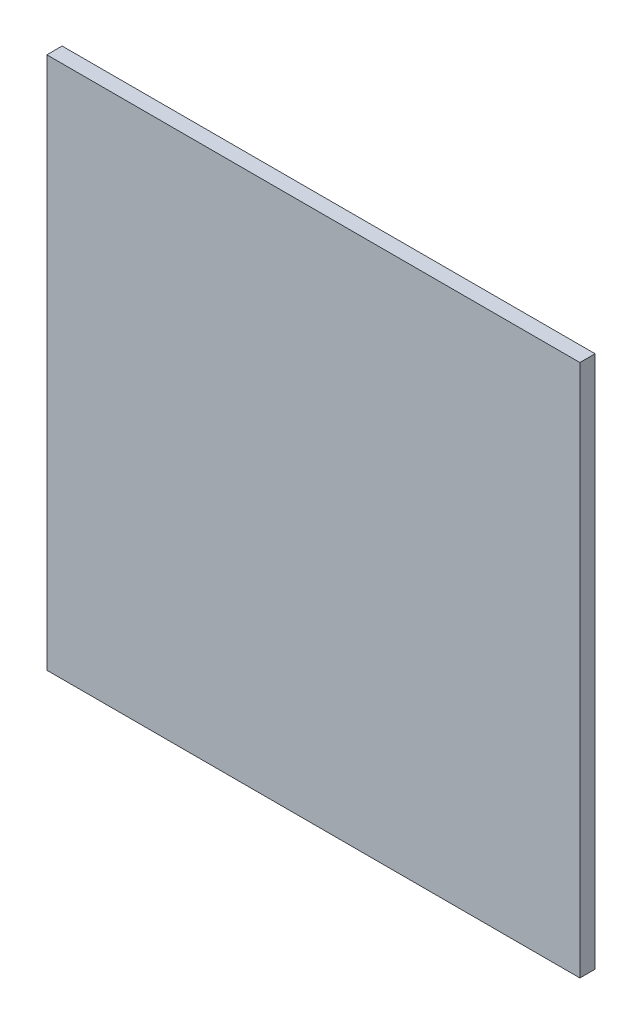
ISO-10303-21;
HEADER;
FILE_DESCRIPTION(('STEP AP214'),'2;1');
FILE_NAME('part.step','',(''),(''),'','','');
FILE_SCHEMA(('AUTOMOTIVE_DESIGN { 1 0 10303 214 1 1 1 1 }'));
ENDSEC;
DATA;
#1=APPLICATION_CONTEXT('core data for automotive mechanical design processes');
#2=APPLICATION_PROTOCOL_DEFINITION('international standard','automotive_design',2000,#1);
#3=PRODUCT_CONTEXT('',#1,'mechanical');
#4=PRODUCT('Part','Part','',(#3));
#5=PRODUCT_RELATED_PRODUCT_CATEGORY('part','',(#4));
#6=PRODUCT_DEFINITION_FORMATION('','',#4);
#7=PRODUCT_DEFINITION_CONTEXT('part definition',#1,'design');
#8=PRODUCT_DEFINITION('design','',#6,#7);
#9=PRODUCT_DEFINITION_SHAPE('','',#8);
#10=(LENGTH_UNIT() NAMED_UNIT(*) SI_UNIT(.MILLI.,.METRE.));
#11=(NAMED_UNIT(*) PLANE_ANGLE_UNIT() SI_UNIT($,.RADIAN.));
#12=(NAMED_UNIT(*) SI_UNIT($,.STERADIAN.) SOLID_ANGLE_UNIT());
#13=UNCERTAINTY_MEASURE_WITH_UNIT(LENGTH_MEASURE(1.E-05),#10,'distance_accuracy_value','');
#14=(GEOMETRIC_REPRESENTATION_CONTEXT(3) GLOBAL_UNCERTAINTY_ASSIGNED_CONTEXT((#13)) GLOBAL_UNIT_ASSIGNED_CONTEXT((#10,
#11,#12)) REPRESENTATION_CONTEXT('',''));
#15=CARTESIAN_POINT('',(0.,0.,0.));
#16=DIRECTION('',(0.,0.,1.));
#17=DIRECTION('',(1.,0.,0.));
#18=AXIS2_PLACEMENT_3D('',#15,#16,#17);
#19=CARTESIAN_POINT('',(0.,0.,1.));
#20=DIRECTION('',(1.,0.,0.));
#21=DIRECTION('',(0.,1.,0.));
#22=AXIS2_PLACEMENT_3D('',#19,#20,#21);
#23=PLANE('',#22);
#24=DIRECTION('',(0.,-1.,0.));
#25=VECTOR('',#24,1.);
#26=CARTESIAN_POINT('',(0.,0.,0.));
#27=LINE('',#26,#25);
#28=CARTESIAN_POINT('',(0.,0.,0.));
#29=VERTEX_POINT('',#28);
#30=CARTESIAN_POINT('',(0.,-35.,0.));
#31=VERTEX_POINT('',#30);
#32=EDGE_CURVE('E103',#29,#31,#27,.T.);
#33=ORIENTED_EDGE('',*,*,#32,.T.);
#34=DIRECTION('',(0.,0.,-1.));
#35=VECTOR('',#34,1.);
#36=CARTESIAN_POINT('',(0.,-35.,1.));
#37=LINE('',#36,#35);
#38=CARTESIAN_POINT('',(0.,-35.,1.));
#39=VERTEX_POINT('',#38);
#40=EDGE_CURVE('E94',#39,#31,#37,.T.);
#41=ORIENTED_EDGE('',*,*,#40,.F.);
#42=DIRECTION('',(0.,-1.,0.));
#43=VECTOR('',#42,1.);
#44=CARTESIAN_POINT('',(0.,0.,1.));
#45=LINE('',#44,#43);
#46=CARTESIAN_POINT('',(0.,0.,1.));
#47=VERTEX_POINT('',#46);
#48=EDGE_CURVE('E88',#47,#39,#45,.T.);
#49=ORIENTED_EDGE('',*,*,#48,.F.);
#50=DIRECTION('',(0.,0.,-1.));
#51=VECTOR('',#50,1.);
#52=CARTESIAN_POINT('',(0.,0.,1.));
#53=LINE('',#52,#51);
#54=EDGE_CURVE('E99',#47,#29,#53,.T.);
#55=ORIENTED_EDGE('',*,*,#54,.T.);
#56=EDGE_LOOP('',(#33,#41,#49,#55));
#57=FACE_BOUND('',#56,.T.);
#58=ADVANCED_FACE('F34',(#57),#23,.F.);
#59=CARTESIAN_POINT('',(0.,-35.,1.));
#60=DIRECTION('',(0.,1.,0.));
#61=DIRECTION('',(0.,0.,1.));
#62=AXIS2_PLACEMENT_3D('',#59,#60,#61);
#63=PLANE('',#62);
#64=DIRECTION('',(1.,0.,0.));
#65=VECTOR('',#64,1.);
#66=CARTESIAN_POINT('',(0.,-35.,0.));
#67=LINE('',#66,#65);
#68=CARTESIAN_POINT('',(35.,-35.,0.));
#69=VERTEX_POINT('',#68);
#70=EDGE_CURVE('E93',#31,#69,#67,.T.);
#71=ORIENTED_EDGE('',*,*,#70,.T.);
#72=DIRECTION('',(0.,0.,-1.));
#73=VECTOR('',#72,1.);
#74=CARTESIAN_POINT('',(35.,-35.,1.));
#75=LINE('',#74,#73);
#76=CARTESIAN_POINT('',(35.,-35.,1.));
#77=VERTEX_POINT('',#76);
#78=EDGE_CURVE('E91',#77,#69,#75,.T.);
#79=ORIENTED_EDGE('',*,*,#78,.F.);
#80=DIRECTION('',(1.,0.,0.));
#81=VECTOR('',#80,1.);
#82=CARTESIAN_POINT('',(0.,-35.,1.));
#83=LINE('',#82,#81);
#84=EDGE_CURVE('E83',#39,#77,#83,.T.);
#85=ORIENTED_EDGE('',*,*,#84,.F.);
#86=ORIENTED_EDGE('',*,*,#40,.T.);
#87=EDGE_LOOP('',(#71,#79,#85,#86));
#88=FACE_BOUND('',#87,.T.);
#89=ADVANCED_FACE('F92',(#88),#63,.F.);
#90=CARTESIAN_POINT('',(35.,0.,1.));
#91=DIRECTION('',(-1.,0.,0.));
#92=DIRECTION('',(0.,-1.,0.));
#93=AXIS2_PLACEMENT_3D('',#90,#91,#92);
#94=PLANE('',#93);
#95=DIRECTION('',(0.,1.,0.));
#96=VECTOR('',#95,1.);
#97=CARTESIAN_POINT('',(35.,0.,0.));
#98=LINE('',#97,#96);
#99=CARTESIAN_POINT('',(35.,0.,0.));
#100=VERTEX_POINT('',#99);
#101=EDGE_CURVE('E69',#69,#100,#98,.T.);
#102=ORIENTED_EDGE('',*,*,#101,.T.);
#103=DIRECTION('',(0.,0.,-1.));
#104=VECTOR('',#103,1.);
#105=CARTESIAN_POINT('',(35.,0.,1.));
#106=LINE('',#105,#104);
#107=CARTESIAN_POINT('',(35.,0.,1.));
#108=VERTEX_POINT('',#107);
#109=EDGE_CURVE('E95',#108,#100,#106,.T.);
#110=ORIENTED_EDGE('',*,*,#109,.F.);
#111=DIRECTION('',(0.,1.,0.));
#112=VECTOR('',#111,1.);
#113=CARTESIAN_POINT('',(35.,0.,1.));
#114=LINE('',#113,#112);
#115=EDGE_CURVE('E86',#77,#108,#114,.T.);
#116=ORIENTED_EDGE('',*,*,#115,.F.);
#117=ORIENTED_EDGE('',*,*,#78,.T.);
#118=EDGE_LOOP('',(#102,#110,#116,#117));
#119=FACE_BOUND('',#118,.T.);
#120=ADVANCED_FACE('F97',(#119),#94,.F.);
#121=CARTESIAN_POINT('',(0.,0.,1.));
#122=DIRECTION('',(0.,-1.,0.));
#123=DIRECTION('',(0.,0.,-1.));
#124=AXIS2_PLACEMENT_3D('',#121,#122,#123);
#125=PLANE('',#124);
#126=DIRECTION('',(-1.,0.,0.));
#127=VECTOR('',#126,1.);
#128=CARTESIAN_POINT('',(0.,0.,0.));
#129=LINE('',#128,#127);
#130=EDGE_CURVE('E75',#100,#29,#129,.T.);
#131=ORIENTED_EDGE('',*,*,#130,.T.);
#132=ORIENTED_EDGE('',*,*,#54,.F.);
#133=DIRECTION('',(-1.,0.,0.));
#134=VECTOR('',#133,1.);
#135=CARTESIAN_POINT('',(0.,0.,1.));
#136=LINE('',#135,#134);
#137=EDGE_CURVE('E52',#108,#47,#136,.T.);
#138=ORIENTED_EDGE('',*,*,#137,.F.);
#139=ORIENTED_EDGE('',*,*,#109,.T.);
#140=EDGE_LOOP('',(#131,#132,#138,#139));
#141=FACE_BOUND('',#140,.T.);
#142=ADVANCED_FACE('F152',(#141),#125,.F.);
#143=CARTESIAN_POINT('',(0.,0.,1.));
#144=DIRECTION('',(0.,0.,1.));
#145=DIRECTION('',(1.,0.,0.));
#146=AXIS2_PLACEMENT_3D('',#143,#144,#145);
#147=PLANE('',#146);
#148=ORIENTED_EDGE('',*,*,#48,.T.);
#149=ORIENTED_EDGE('',*,*,#84,.T.);
#150=ORIENTED_EDGE('',*,*,#115,.T.);
#151=ORIENTED_EDGE('',*,*,#137,.T.);
#152=EDGE_LOOP('',(#148,#149,#150,#151));
#153=FACE_BOUND('',#152,.T.);
#154=ADVANCED_FACE('F84',(#153),#147,.T.);
#155=CARTESIAN_POINT('',(0.,0.,0.));
#156=DIRECTION('',(0.,0.,1.));
#157=DIRECTION('',(1.,0.,0.));
#158=AXIS2_PLACEMENT_3D('',#155,#156,#157);
#159=PLANE('',#158);
#160=CARTESIAN_POINT('',(5.,-17.5,0.));
#161=DIRECTION('',(0.,0.,1.));
#162=DIRECTION('',(1.,0.,0.));
#163=AXIS2_PLACEMENT_3D('',#160,#161,#162);
#164=CIRCLE('',#163,0.999999999999998);
#165=CARTESIAN_POINT('',(6.,-17.5,0.));
#166=VERTEX_POINT('',#165);
#167=EDGE_CURVE('E115',#166,#166,#164,.F.);
#168=ORIENTED_EDGE('',*,*,#167,.F.);
#169=EDGE_LOOP('',(#168));
#170=FACE_BOUND('',#169,.T.);
#171=CARTESIAN_POINT('',(30.,-17.5,0.));
#172=DIRECTION('',(0.,0.,1.));
#173=DIRECTION('',(1.,0.,0.));
#174=AXIS2_PLACEMENT_3D('',#171,#172,#173);
#175=CIRCLE('',#174,0.999999999999998);
#176=CARTESIAN_POINT('',(31.,-17.5,0.));
#177=VERTEX_POINT('',#176);
#178=EDGE_CURVE('E112',#177,#177,#175,.F.);
#179=ORIENTED_EDGE('',*,*,#178,.F.);
#180=EDGE_LOOP('',(#179));
#181=FACE_BOUND('',#180,.T.);
#182=ORIENTED_EDGE('',*,*,#32,.F.);
#183=ORIENTED_EDGE('',*,*,#130,.F.);
#184=ORIENTED_EDGE('',*,*,#101,.F.);
#185=ORIENTED_EDGE('',*,*,#70,.F.);
#186=EDGE_LOOP('',(#182,#183,#184,#185));
#187=FACE_BOUND('',#186,.T.);
#188=ADVANCED_FACE('F155',(#170,#181,#187),#159,.F.);
#189=CARTESIAN_POINT('',(30.,-17.5,-3.));
#190=DIRECTION('',(0.,0.,1.));
#191=DIRECTION('',(1.,0.,0.));
#192=AXIS2_PLACEMENT_3D('',#189,#190,#191);
#193=CYLINDRICAL_SURFACE('',#192,0.999999999999998);
#194=CARTESIAN_POINT('',(30.,-17.5,-2.49999999999999));
#195=DIRECTION('',(0.,0.,-1.));
#196=DIRECTION('',(-1.,0.,0.));
#197=AXIS2_PLACEMENT_3D('',#194,#195,#196);
#198=CIRCLE('',#197,0.999999999999998);
#199=CARTESIAN_POINT('',(29.,-17.5,-2.49999999999999));
#200=VERTEX_POINT('',#199);
#201=EDGE_CURVE('E11',#200,#200,#198,.F.);
#202=ORIENTED_EDGE('',*,*,#201,.T.);
#203=EDGE_LOOP('',(#202));
#204=FACE_BOUND('',#203,.T.);
#205=ORIENTED_EDGE('',*,*,#178,.T.);
#206=EDGE_LOOP('',(#205));
#207=FACE_BOUND('',#206,.T.);
#208=ADVANCED_FACE('F158',(#204,#207),#193,.T.);
#209=CARTESIAN_POINT('',(30.,-17.5,-3.));
#210=DIRECTION('',(0.,0.,-1.));
#211=DIRECTION('',(-1.,0.,0.));
#212=AXIS2_PLACEMENT_3D('',#209,#210,#211);
#213=PLANE('',#212);
#214=CARTESIAN_POINT('',(30.,-17.5,-3.));
#215=DIRECTION('',(0.,0.,-1.));
#216=DIRECTION('',(-1.,0.,0.));
#217=AXIS2_PLACEMENT_3D('',#214,#215,#216);
#218=CIRCLE('',#217,0.499999999999994);
#219=CARTESIAN_POINT('',(29.5,-17.5,-3.));
#220=VERTEX_POINT('',#219);
#221=EDGE_CURVE('E44',#220,#220,#218,.T.);
#222=ORIENTED_EDGE('',*,*,#221,.T.);
#223=EDGE_LOOP('',(#222));
#224=FACE_BOUND('',#223,.T.);
#225=ADVANCED_FACE('F126',(#224),#213,.T.);
#226=CARTESIAN_POINT('',(5.,-17.5,-3.));
#227=DIRECTION('',(0.,0.,1.));
#228=DIRECTION('',(1.,0.,0.));
#229=AXIS2_PLACEMENT_3D('',#226,#227,#228);
#230=CYLINDRICAL_SURFACE('',#229,0.999999999999998);
#231=CARTESIAN_POINT('',(5.,-17.5,-2.50000000000001));
#232=DIRECTION('',(0.,0.,-1.));
#233=DIRECTION('',(-1.,0.,0.));
#234=AXIS2_PLACEMENT_3D('',#231,#232,#233);
#235=CIRCLE('',#234,0.999999999999998);
#236=CARTESIAN_POINT('',(4.,-17.5,-2.50000000000001));
#237=VERTEX_POINT('',#236);
#238=EDGE_CURVE('E121',#237,#237,#235,.F.);
#239=ORIENTED_EDGE('',*,*,#238,.T.);
#240=EDGE_LOOP('',(#239));
#241=FACE_BOUND('',#240,.T.);
#242=ORIENTED_EDGE('',*,*,#167,.T.);
#243=EDGE_LOOP('',(#242));
#244=FACE_BOUND('',#243,.T.);
#245=ADVANCED_FACE('F167',(#241,#244),#230,.T.);
#246=CARTESIAN_POINT('',(5.,-17.5,-3.));
#247=DIRECTION('',(0.,0.,-1.));
#248=DIRECTION('',(-1.,0.,0.));
#249=AXIS2_PLACEMENT_3D('',#246,#247,#248);
#250=PLANE('',#249);
#251=CARTESIAN_POINT('',(5.,-17.5,-3.));
#252=DIRECTION('',(0.,0.,-1.));
#253=DIRECTION('',(-1.,0.,0.));
#254=AXIS2_PLACEMENT_3D('',#251,#252,#253);
#255=CIRCLE('',#254,0.5);
#256=CARTESIAN_POINT('',(4.5,-17.5,-3.));
#257=VERTEX_POINT('',#256);
#258=EDGE_CURVE('E118',#257,#257,#255,.T.);
#259=ORIENTED_EDGE('',*,*,#258,.T.);
#260=EDGE_LOOP('',(#259));
#261=FACE_BOUND('',#260,.T.);
#262=ADVANCED_FACE('F134',(#261),#250,.T.);
#263=CARTESIAN_POINT('',(5.,-17.5,-3.));
#264=DIRECTION('',(0.,0.,1.));
#265=DIRECTION('',(1.,0.,0.));
#266=AXIS2_PLACEMENT_3D('',#263,#264,#265);
#267=CONICAL_SURFACE('',#266,0.5,0.785398163397452);
#268=ORIENTED_EDGE('',*,*,#238,.F.);
#269=EDGE_LOOP('',(#268));
#270=FACE_BOUND('',#269,.T.);
#271=ORIENTED_EDGE('',*,*,#258,.F.);
#272=EDGE_LOOP('',(#271));
#273=FACE_BOUND('',#272,.T.);
#274=ADVANCED_FACE('F129',(#270,#273),#267,.T.);
#275=CARTESIAN_POINT('',(30.,-17.5,-3.));
#276=DIRECTION('',(0.,0.,1.));
#277=DIRECTION('',(1.,0.,0.));
#278=AXIS2_PLACEMENT_3D('',#275,#276,#277);
#279=CONICAL_SURFACE('',#278,0.499999999999994,0.785398163397445);
#280=ORIENTED_EDGE('',*,*,#201,.F.);
#281=EDGE_LOOP('',(#280));
#282=FACE_BOUND('',#281,.T.);
#283=ORIENTED_EDGE('',*,*,#221,.F.);
#284=EDGE_LOOP('',(#283));
#285=FACE_BOUND('',#284,.T.);
#286=ADVANCED_FACE('F37',(#282,#285),#279,.T.);
#287=CLOSED_SHELL('',(#58,#89,#120,#142,#154,#188,#208,#225,#245,#262,#274,#286));
#288=MANIFOLD_SOLID_BREP('B2',#287);
#289=ADVANCED_BREP_SHAPE_REPRESENTATION('',(#18,#288),#14);
#290=SHAPE_DEFINITION_REPRESENTATION(#9,#289);
ENDSEC;
END-ISO-10303-21;
